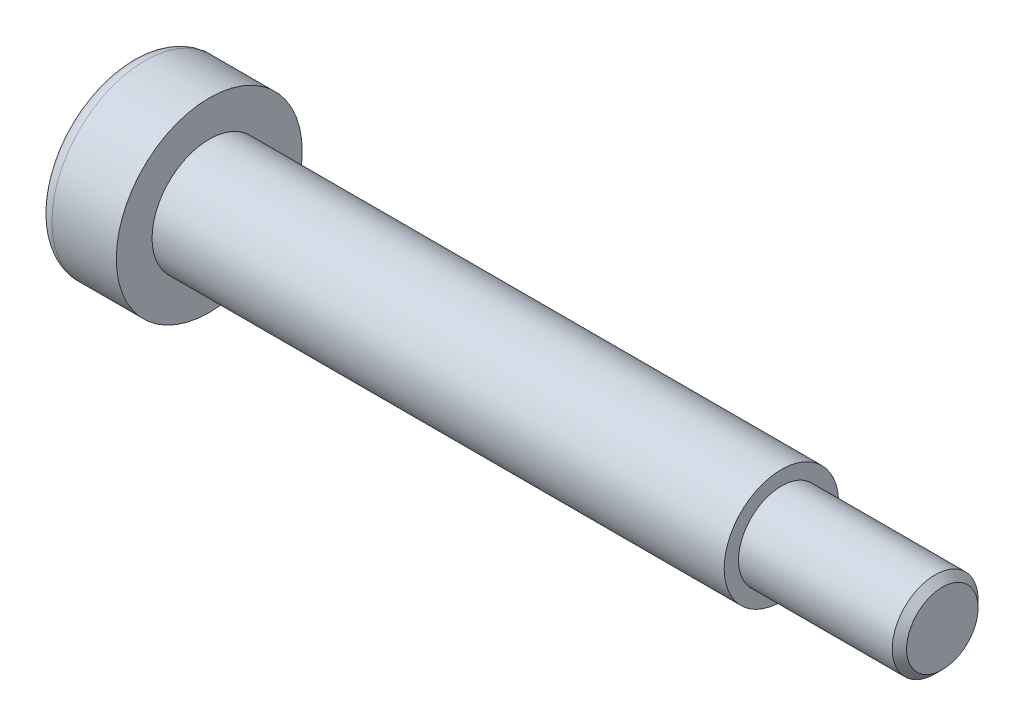
ISO-10303-21;
HEADER;
FILE_DESCRIPTION(('STEP AP214'),'2;1');
FILE_NAME('part.step','',(''),(''),'','','');
FILE_SCHEMA(('AUTOMOTIVE_DESIGN { 1 0 10303 214 1 1 1 1 }'));
ENDSEC;
DATA;
#1=APPLICATION_CONTEXT('core data for automotive mechanical design processes');
#2=APPLICATION_PROTOCOL_DEFINITION('international standard','automotive_design',2000,#1);
#3=PRODUCT_CONTEXT('',#1,'mechanical');
#4=PRODUCT('Part','Part','',(#3));
#5=PRODUCT_RELATED_PRODUCT_CATEGORY('part','',(#4));
#6=PRODUCT_DEFINITION_FORMATION('','',#4);
#7=PRODUCT_DEFINITION_CONTEXT('part definition',#1,'design');
#8=PRODUCT_DEFINITION('design','',#6,#7);
#9=PRODUCT_DEFINITION_SHAPE('','',#8);
#10=(LENGTH_UNIT() NAMED_UNIT(*) SI_UNIT(.MILLI.,.METRE.));
#11=(NAMED_UNIT(*) PLANE_ANGLE_UNIT() SI_UNIT($,.RADIAN.));
#12=(NAMED_UNIT(*) SI_UNIT($,.STERADIAN.) SOLID_ANGLE_UNIT());
#13=UNCERTAINTY_MEASURE_WITH_UNIT(LENGTH_MEASURE(1.E-05),#10,'distance_accuracy_value','');
#14=(GEOMETRIC_REPRESENTATION_CONTEXT(3) GLOBAL_UNCERTAINTY_ASSIGNED_CONTEXT((#13)) GLOBAL_UNIT_ASSIGNED_CONTEXT((#10,
#11,#12)) REPRESENTATION_CONTEXT('',''));
#15=CARTESIAN_POINT('',(0.,0.,0.));
#16=DIRECTION('',(0.,0.,1.));
#17=DIRECTION('',(1.,0.,0.));
#18=AXIS2_PLACEMENT_3D('',#15,#16,#17);
#19=CARTESIAN_POINT('',(0.,0.,0.));
#20=DIRECTION('',(1.,0.,0.));
#21=DIRECTION('',(0.,0.,-1.));
#22=AXIS2_PLACEMENT_3D('',#19,#20,#21);
#23=PLANE('',#22);
#24=CARTESIAN_POINT('',(0.,0.,0.));
#25=DIRECTION('',(1.,0.,0.));
#26=DIRECTION('',(0.,0.,-1.));
#27=AXIS2_PLACEMENT_3D('',#24,#25,#26);
#28=CIRCLE('',#27,5.5);
#29=CARTESIAN_POINT('',(0.,0.,-5.5));
#30=VERTEX_POINT('',#29);
#31=EDGE_CURVE('E155',#30,#30,#28,.F.);
#32=ORIENTED_EDGE('',*,*,#31,.T.);
#33=EDGE_LOOP('',(#32));
#34=FACE_BOUND('',#33,.T.);
#35=DIRECTION('',(0.,-0.5,-0.866025403784439));
#36=VECTOR('',#35,1.);
#37=CARTESIAN_POINT('',(0.,2.3094010767585,0.));
#38=LINE('',#37,#36);
#39=CARTESIAN_POINT('',(0.,2.3094010767585,0.));
#40=VERTEX_POINT('',#39);
#41=CARTESIAN_POINT('',(0.,1.15470053837925,-2.));
#42=VERTEX_POINT('',#41);
#43=EDGE_CURVE('E125',#40,#42,#38,.T.);
#44=ORIENTED_EDGE('',*,*,#43,.F.);
#45=DIRECTION('',(0.,0.5,-0.866025403784439));
#46=VECTOR('',#45,1.);
#47=CARTESIAN_POINT('',(0.,1.15470053837925,2.));
#48=LINE('',#47,#46);
#49=CARTESIAN_POINT('',(0.,1.15470053837925,2.));
#50=VERTEX_POINT('',#49);
#51=EDGE_CURVE('E51',#50,#40,#48,.T.);
#52=ORIENTED_EDGE('',*,*,#51,.F.);
#53=DIRECTION('',(0.,1.,0.));
#54=VECTOR('',#53,1.);
#55=CARTESIAN_POINT('',(0.,-1.15470053837925,2.));
#56=LINE('',#55,#54);
#57=CARTESIAN_POINT('',(0.,-1.15470053837925,2.));
#58=VERTEX_POINT('',#57);
#59=EDGE_CURVE('E134',#58,#50,#56,.T.);
#60=ORIENTED_EDGE('',*,*,#59,.F.);
#61=DIRECTION('',(0.,0.5,0.866025403784439));
#62=VECTOR('',#61,1.);
#63=CARTESIAN_POINT('',(0.,-2.3094010767585,0.));
#64=LINE('',#63,#62);
#65=CARTESIAN_POINT('',(0.,-2.3094010767585,0.));
#66=VERTEX_POINT('',#65);
#67=EDGE_CURVE('E132',#66,#58,#64,.T.);
#68=ORIENTED_EDGE('',*,*,#67,.F.);
#69=DIRECTION('',(0.,-0.5,0.866025403784439));
#70=VECTOR('',#69,1.);
#71=CARTESIAN_POINT('',(0.,-1.15470053837925,-2.));
#72=LINE('',#71,#70);
#73=CARTESIAN_POINT('',(0.,-1.15470053837925,-2.));
#74=VERTEX_POINT('',#73);
#75=EDGE_CURVE('E99',#74,#66,#72,.T.);
#76=ORIENTED_EDGE('',*,*,#75,.F.);
#77=DIRECTION('',(0.,-1.,0.));
#78=VECTOR('',#77,1.);
#79=CARTESIAN_POINT('',(0.,1.15470053837925,-2.));
#80=LINE('',#79,#78);
#81=EDGE_CURVE('E128',#42,#74,#80,.T.);
#82=ORIENTED_EDGE('',*,*,#81,.F.);
#83=EDGE_LOOP('',(#44,#52,#60,#68,#76,#82));
#84=FACE_BOUND('',#83,.T.);
#85=ADVANCED_FACE('F36',(#34,#84),#23,.F.);
#86=CARTESIAN_POINT('',(0.,0.,0.));
#87=DIRECTION('',(-1.,0.,0.));
#88=DIRECTION('',(0.,0.,1.));
#89=AXIS2_PLACEMENT_3D('',#86,#87,#88);
#90=CYLINDRICAL_SURFACE('',#89,6.5);
#91=CARTESIAN_POINT('',(1.,0.,0.));
#92=DIRECTION('',(1.,0.,0.));
#93=DIRECTION('',(0.,0.,-1.));
#94=AXIS2_PLACEMENT_3D('',#91,#92,#93);
#95=CIRCLE('',#94,6.5);
#96=CARTESIAN_POINT('',(1.,0.,-6.5));
#97=VERTEX_POINT('',#96);
#98=EDGE_CURVE('E158',#97,#97,#95,.T.);
#99=ORIENTED_EDGE('',*,*,#98,.T.);
#100=EDGE_LOOP('',(#99));
#101=FACE_BOUND('',#100,.T.);
#102=CARTESIAN_POINT('',(5.5,0.,0.));
#103=DIRECTION('',(-1.,0.,0.));
#104=DIRECTION('',(0.,0.,1.));
#105=AXIS2_PLACEMENT_3D('',#102,#103,#104);
#106=CIRCLE('',#105,6.5);
#107=CARTESIAN_POINT('',(5.5,0.,6.5));
#108=VERTEX_POINT('',#107);
#109=EDGE_CURVE('E152',#108,#108,#106,.T.);
#110=ORIENTED_EDGE('',*,*,#109,.T.);
#111=EDGE_LOOP('',(#110));
#112=FACE_BOUND('',#111,.T.);
#113=ADVANCED_FACE('F175',(#101,#112),#90,.T.);
#114=CARTESIAN_POINT('',(5.5,6.5,0.));
#115=DIRECTION('',(-1.,0.,0.));
#116=DIRECTION('',(0.,0.,1.));
#117=AXIS2_PLACEMENT_3D('',#114,#115,#116);
#118=PLANE('',#117);
#119=ORIENTED_EDGE('',*,*,#109,.F.);
#120=EDGE_LOOP('',(#119));
#121=FACE_BOUND('',#120,.T.);
#122=CARTESIAN_POINT('',(5.5,0.,0.));
#123=DIRECTION('',(-1.,0.,0.));
#124=DIRECTION('',(0.,0.,1.));
#125=AXIS2_PLACEMENT_3D('',#122,#123,#124);
#126=CIRCLE('',#125,4.);
#127=CARTESIAN_POINT('',(5.5,0.,4.));
#128=VERTEX_POINT('',#127);
#129=EDGE_CURVE('E149',#128,#128,#126,.T.);
#130=ORIENTED_EDGE('',*,*,#129,.T.);
#131=EDGE_LOOP('',(#130));
#132=FACE_BOUND('',#131,.T.);
#133=ADVANCED_FACE('F181',(#121,#132),#118,.F.);
#134=CARTESIAN_POINT('',(0.,0.,0.));
#135=DIRECTION('',(-1.,0.,0.));
#136=DIRECTION('',(0.,0.,1.));
#137=AXIS2_PLACEMENT_3D('',#134,#135,#136);
#138=CYLINDRICAL_SURFACE('',#137,4.);
#139=ORIENTED_EDGE('',*,*,#129,.F.);
#140=EDGE_LOOP('',(#139));
#141=FACE_BOUND('',#140,.T.);
#142=CARTESIAN_POINT('',(45.5,0.,0.));
#143=DIRECTION('',(-1.,0.,0.));
#144=DIRECTION('',(0.,0.,1.));
#145=AXIS2_PLACEMENT_3D('',#142,#143,#144);
#146=CIRCLE('',#145,4.);
#147=CARTESIAN_POINT('',(45.5,0.,4.));
#148=VERTEX_POINT('',#147);
#149=EDGE_CURVE('E146',#148,#148,#146,.T.);
#150=ORIENTED_EDGE('',*,*,#149,.T.);
#151=EDGE_LOOP('',(#150));
#152=FACE_BOUND('',#151,.T.);
#153=ADVANCED_FACE('F188',(#141,#152),#138,.T.);
#154=CARTESIAN_POINT('',(45.5,4.,0.));
#155=DIRECTION('',(-1.,0.,0.));
#156=DIRECTION('',(0.,0.,1.));
#157=AXIS2_PLACEMENT_3D('',#154,#155,#156);
#158=PLANE('',#157);
#159=ORIENTED_EDGE('',*,*,#149,.F.);
#160=EDGE_LOOP('',(#159));
#161=FACE_BOUND('',#160,.T.);
#162=CARTESIAN_POINT('',(45.5,0.,0.));
#163=DIRECTION('',(-1.,0.,0.));
#164=DIRECTION('',(0.,0.,1.));
#165=AXIS2_PLACEMENT_3D('',#162,#163,#164);
#166=CIRCLE('',#165,3.);
#167=CARTESIAN_POINT('',(45.5,0.,3.));
#168=VERTEX_POINT('',#167);
#169=EDGE_CURVE('E138',#168,#168,#166,.T.);
#170=ORIENTED_EDGE('',*,*,#169,.T.);
#171=EDGE_LOOP('',(#170));
#172=FACE_BOUND('',#171,.T.);
#173=ADVANCED_FACE('F192',(#161,#172),#158,.F.);
#174=CARTESIAN_POINT('',(0.,0.,0.));
#175=DIRECTION('',(-1.,0.,0.));
#176=DIRECTION('',(0.,0.,1.));
#177=AXIS2_PLACEMENT_3D('',#174,#175,#176);
#178=CYLINDRICAL_SURFACE('',#177,3.);
#179=CARTESIAN_POINT('',(56.25,0.,0.));
#180=DIRECTION('',(-1.,0.,0.));
#181=DIRECTION('',(0.,0.,1.));
#182=AXIS2_PLACEMENT_3D('',#179,#180,#181);
#183=CIRCLE('',#182,3.);
#184=CARTESIAN_POINT('',(56.25,0.,3.));
#185=VERTEX_POINT('',#184);
#186=EDGE_CURVE('E44',#185,#185,#183,.T.);
#187=ORIENTED_EDGE('',*,*,#186,.T.);
#188=EDGE_LOOP('',(#187));
#189=FACE_BOUND('',#188,.T.);
#190=ORIENTED_EDGE('',*,*,#169,.F.);
#191=EDGE_LOOP('',(#190));
#192=FACE_BOUND('',#191,.T.);
#193=ADVANCED_FACE('F163',(#189,#192),#178,.T.);
#194=CARTESIAN_POINT('',(56.75,3.,0.));
#195=DIRECTION('',(-1.,0.,0.));
#196=DIRECTION('',(0.,0.,1.));
#197=AXIS2_PLACEMENT_3D('',#194,#195,#196);
#198=PLANE('',#197);
#199=CARTESIAN_POINT('',(56.75,0.,0.));
#200=DIRECTION('',(-1.,0.,0.));
#201=DIRECTION('',(0.,0.,1.));
#202=AXIS2_PLACEMENT_3D('',#199,#200,#201);
#203=CIRCLE('',#202,2.5);
#204=CARTESIAN_POINT('',(56.75,0.,2.5));
#205=VERTEX_POINT('',#204);
#206=EDGE_CURVE('E11',#205,#205,#203,.F.);
#207=ORIENTED_EDGE('',*,*,#206,.T.);
#208=EDGE_LOOP('',(#207));
#209=FACE_BOUND('',#208,.T.);
#210=ADVANCED_FACE('F199',(#209),#198,.F.);
#211=CARTESIAN_POINT('',(3.3,1.15470053837925,2.));
#212=DIRECTION('',(0.,0.866025403784439,0.5));
#213=DIRECTION('',(0.,-0.5,0.866025403784439));
#214=AXIS2_PLACEMENT_3D('',#211,#212,#213);
#215=PLANE('',#214);
#216=ORIENTED_EDGE('',*,*,#51,.T.);
#217=DIRECTION('',(-1.,0.,0.));
#218=VECTOR('',#217,1.);
#219=CARTESIAN_POINT('',(3.3,2.3094010767585,0.));
#220=LINE('',#219,#218);
#221=CARTESIAN_POINT('',(3.3,2.3094010767585,0.));
#222=VERTEX_POINT('',#221);
#223=EDGE_CURVE('E81',#222,#40,#220,.T.);
#224=ORIENTED_EDGE('',*,*,#223,.F.);
#225=DIRECTION('',(0.,0.5,-0.866025403784439));
#226=VECTOR('',#225,1.);
#227=CARTESIAN_POINT('',(3.3,1.15470053837925,2.));
#228=LINE('',#227,#226);
#229=CARTESIAN_POINT('',(3.3,1.15470053837925,2.));
#230=VERTEX_POINT('',#229);
#231=EDGE_CURVE('E136',#230,#222,#228,.T.);
#232=ORIENTED_EDGE('',*,*,#231,.F.);
#233=DIRECTION('',(-1.,0.,0.));
#234=VECTOR('',#233,1.);
#235=CARTESIAN_POINT('',(3.3,1.15470053837925,2.));
#236=LINE('',#235,#234);
#237=EDGE_CURVE('E59',#230,#50,#236,.T.);
#238=ORIENTED_EDGE('',*,*,#237,.T.);
#239=EDGE_LOOP('',(#216,#224,#232,#238));
#240=FACE_BOUND('',#239,.T.);
#241=ADVANCED_FACE('F202',(#240),#215,.F.);
#242=CARTESIAN_POINT('',(3.3,-1.15470053837925,2.));
#243=DIRECTION('',(0.,0.,1.));
#244=DIRECTION('',(0.,-1.,0.));
#245=AXIS2_PLACEMENT_3D('',#242,#243,#244);
#246=PLANE('',#245);
#247=ORIENTED_EDGE('',*,*,#59,.T.);
#248=ORIENTED_EDGE('',*,*,#237,.F.);
#249=DIRECTION('',(0.,1.,0.));
#250=VECTOR('',#249,1.);
#251=CARTESIAN_POINT('',(3.3,-1.15470053837925,2.));
#252=LINE('',#251,#250);
#253=CARTESIAN_POINT('',(3.3,-1.15470053837925,2.));
#254=VERTEX_POINT('',#253);
#255=EDGE_CURVE('E111',#254,#230,#252,.T.);
#256=ORIENTED_EDGE('',*,*,#255,.F.);
#257=DIRECTION('',(-1.,0.,0.));
#258=VECTOR('',#257,1.);
#259=CARTESIAN_POINT('',(3.3,-1.15470053837925,2.));
#260=LINE('',#259,#258);
#261=EDGE_CURVE('E103',#254,#58,#260,.T.);
#262=ORIENTED_EDGE('',*,*,#261,.T.);
#263=EDGE_LOOP('',(#247,#248,#256,#262));
#264=FACE_BOUND('',#263,.T.);
#265=ADVANCED_FACE('F206',(#264),#246,.F.);
#266=CARTESIAN_POINT('',(3.3,-2.3094010767585,0.));
#267=DIRECTION('',(0.,-0.866025403784439,0.5));
#268=DIRECTION('',(0.,-0.5,-0.866025403784439));
#269=AXIS2_PLACEMENT_3D('',#266,#267,#268);
#270=PLANE('',#269);
#271=ORIENTED_EDGE('',*,*,#67,.T.);
#272=ORIENTED_EDGE('',*,*,#261,.F.);
#273=DIRECTION('',(0.,0.5,0.866025403784439));
#274=VECTOR('',#273,1.);
#275=CARTESIAN_POINT('',(3.3,-2.3094010767585,0.));
#276=LINE('',#275,#274);
#277=CARTESIAN_POINT('',(3.3,-2.3094010767585,0.));
#278=VERTEX_POINT('',#277);
#279=EDGE_CURVE('E107',#278,#254,#276,.T.);
#280=ORIENTED_EDGE('',*,*,#279,.F.);
#281=DIRECTION('',(-1.,0.,0.));
#282=VECTOR('',#281,1.);
#283=CARTESIAN_POINT('',(3.3,-2.3094010767585,0.));
#284=LINE('',#283,#282);
#285=EDGE_CURVE('E92',#278,#66,#284,.T.);
#286=ORIENTED_EDGE('',*,*,#285,.T.);
#287=EDGE_LOOP('',(#271,#272,#280,#286));
#288=FACE_BOUND('',#287,.T.);
#289=ADVANCED_FACE('F108',(#288),#270,.F.);
#290=CARTESIAN_POINT('',(3.3,-1.15470053837925,-2.));
#291=DIRECTION('',(0.,-0.866025403784438,-0.5));
#292=DIRECTION('',(0.,0.5,-0.866025403784439));
#293=AXIS2_PLACEMENT_3D('',#290,#291,#292);
#294=PLANE('',#293);
#295=ORIENTED_EDGE('',*,*,#75,.T.);
#296=ORIENTED_EDGE('',*,*,#285,.F.);
#297=DIRECTION('',(0.,-0.5,0.866025403784439));
#298=VECTOR('',#297,1.);
#299=CARTESIAN_POINT('',(3.3,-1.15470053837925,-2.));
#300=LINE('',#299,#298);
#301=CARTESIAN_POINT('',(3.3,-1.15470053837925,-2.));
#302=VERTEX_POINT('',#301);
#303=EDGE_CURVE('E96',#302,#278,#300,.T.);
#304=ORIENTED_EDGE('',*,*,#303,.F.);
#305=DIRECTION('',(-1.,0.,0.));
#306=VECTOR('',#305,1.);
#307=CARTESIAN_POINT('',(3.3,-1.15470053837925,-2.));
#308=LINE('',#307,#306);
#309=EDGE_CURVE('E104',#302,#74,#308,.T.);
#310=ORIENTED_EDGE('',*,*,#309,.T.);
#311=EDGE_LOOP('',(#295,#296,#304,#310));
#312=FACE_BOUND('',#311,.T.);
#313=ADVANCED_FACE('F94',(#312),#294,.F.);
#314=CARTESIAN_POINT('',(3.3,1.15470053837925,-2.));
#315=DIRECTION('',(0.,0.,-1.));
#316=DIRECTION('',(-1.,0.,0.));
#317=AXIS2_PLACEMENT_3D('',#314,#315,#316);
#318=PLANE('',#317);
#319=ORIENTED_EDGE('',*,*,#81,.T.);
#320=ORIENTED_EDGE('',*,*,#309,.F.);
#321=DIRECTION('',(0.,-1.,0.));
#322=VECTOR('',#321,1.);
#323=CARTESIAN_POINT('',(3.3,1.15470053837925,-2.));
#324=LINE('',#323,#322);
#325=CARTESIAN_POINT('',(3.3,1.15470053837925,-2.));
#326=VERTEX_POINT('',#325);
#327=EDGE_CURVE('E117',#326,#302,#324,.T.);
#328=ORIENTED_EDGE('',*,*,#327,.F.);
#329=DIRECTION('',(-1.,0.,0.));
#330=VECTOR('',#329,1.);
#331=CARTESIAN_POINT('',(3.3,1.15470053837925,-2.));
#332=LINE('',#331,#330);
#333=EDGE_CURVE('E141',#326,#42,#332,.T.);
#334=ORIENTED_EDGE('',*,*,#333,.T.);
#335=EDGE_LOOP('',(#319,#320,#328,#334));
#336=FACE_BOUND('',#335,.T.);
#337=ADVANCED_FACE('F210',(#336),#318,.F.);
#338=CARTESIAN_POINT('',(3.3,2.3094010767585,0.));
#339=DIRECTION('',(0.,0.866025403784439,-0.5));
#340=DIRECTION('',(0.,0.5,0.866025403784439));
#341=AXIS2_PLACEMENT_3D('',#338,#339,#340);
#342=PLANE('',#341);
#343=ORIENTED_EDGE('',*,*,#43,.T.);
#344=ORIENTED_EDGE('',*,*,#333,.F.);
#345=DIRECTION('',(0.,-0.5,-0.866025403784439));
#346=VECTOR('',#345,1.);
#347=CARTESIAN_POINT('',(3.3,2.3094010767585,0.));
#348=LINE('',#347,#346);
#349=EDGE_CURVE('E119',#222,#326,#348,.T.);
#350=ORIENTED_EDGE('',*,*,#349,.F.);
#351=ORIENTED_EDGE('',*,*,#223,.T.);
#352=EDGE_LOOP('',(#343,#344,#350,#351));
#353=FACE_BOUND('',#352,.T.);
#354=ADVANCED_FACE('F207',(#353),#342,.F.);
#355=CARTESIAN_POINT('',(3.3,0.,0.));
#356=DIRECTION('',(-1.,0.,0.));
#357=DIRECTION('',(0.,0.,1.));
#358=AXIS2_PLACEMENT_3D('',#355,#356,#357);
#359=PLANE('',#358);
#360=ORIENTED_EDGE('',*,*,#231,.T.);
#361=ORIENTED_EDGE('',*,*,#349,.T.);
#362=ORIENTED_EDGE('',*,*,#327,.T.);
#363=ORIENTED_EDGE('',*,*,#303,.T.);
#364=ORIENTED_EDGE('',*,*,#279,.T.);
#365=ORIENTED_EDGE('',*,*,#255,.T.);
#366=EDGE_LOOP('',(#360,#361,#362,#363,#364,#365));
#367=FACE_BOUND('',#366,.T.);
#368=ADVANCED_FACE('F114',(#367),#359,.T.);
#369=CARTESIAN_POINT('',(1.,0.,0.));
#370=DIRECTION('',(1.,0.,0.));
#371=DIRECTION('',(0.,0.,-1.));
#372=AXIS2_PLACEMENT_3D('',#369,#370,#371);
#373=TOROIDAL_SURFACE('',#372,5.5,1.);
#374=ORIENTED_EDGE('',*,*,#98,.F.);
#375=EDGE_LOOP('',(#374));
#376=FACE_BOUND('',#375,.T.);
#377=ORIENTED_EDGE('',*,*,#31,.F.);
#378=EDGE_LOOP('',(#377));
#379=FACE_BOUND('',#378,.T.);
#380=ADVANCED_FACE('F167',(#376,#379),#373,.T.);
#381=CARTESIAN_POINT('',(56.25,0.,0.));
#382=DIRECTION('',(-1.,0.,0.));
#383=DIRECTION('',(0.,0.,1.));
#384=AXIS2_PLACEMENT_3D('',#381,#382,#383);
#385=CONICAL_SURFACE('',#384,3.,0.785398163397446);
#386=ORIENTED_EDGE('',*,*,#206,.F.);
#387=EDGE_LOOP('',(#386));
#388=FACE_BOUND('',#387,.T.);
#389=ORIENTED_EDGE('',*,*,#186,.F.);
#390=EDGE_LOOP('',(#389));
#391=FACE_BOUND('',#390,.T.);
#392=ADVANCED_FACE('F38',(#388,#391),#385,.T.);
#393=CLOSED_SHELL('',(#85,#113,#133,#153,#173,#193,#210,#241,#265,#289,#313,#337,#354,#368,#380,#392));
#394=MANIFOLD_SOLID_BREP('B2',#393);
#395=ADVANCED_BREP_SHAPE_REPRESENTATION('',(#18,#394),#14);
#396=SHAPE_DEFINITION_REPRESENTATION(#9,#395);
ENDSEC;
END-ISO-10303-21;
